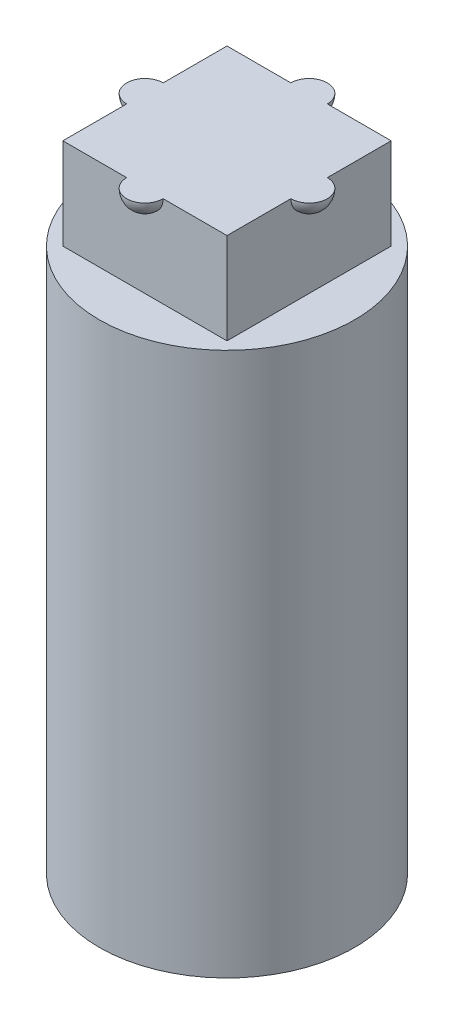
ISO-10303-21;
HEADER;
FILE_DESCRIPTION(('STEP AP214'),'2;1');
FILE_NAME('part.step','',(''),(''),'','','');
FILE_SCHEMA(('AUTOMOTIVE_DESIGN { 1 0 10303 214 1 1 1 1 }'));
ENDSEC;
DATA;
#1=APPLICATION_CONTEXT('core data for automotive mechanical design processes');
#2=APPLICATION_PROTOCOL_DEFINITION('international standard','automotive_design',2000,#1);
#3=PRODUCT_CONTEXT('',#1,'mechanical');
#4=PRODUCT('Part','Part','',(#3));
#5=PRODUCT_RELATED_PRODUCT_CATEGORY('part','',(#4));
#6=PRODUCT_DEFINITION_FORMATION('','',#4);
#7=PRODUCT_DEFINITION_CONTEXT('part definition',#1,'design');
#8=PRODUCT_DEFINITION('design','',#6,#7);
#9=PRODUCT_DEFINITION_SHAPE('','',#8);
#10=(LENGTH_UNIT() NAMED_UNIT(*) SI_UNIT(.MILLI.,.METRE.));
#11=(NAMED_UNIT(*) PLANE_ANGLE_UNIT() SI_UNIT($,.RADIAN.));
#12=(NAMED_UNIT(*) SI_UNIT($,.STERADIAN.) SOLID_ANGLE_UNIT());
#13=UNCERTAINTY_MEASURE_WITH_UNIT(LENGTH_MEASURE(1.E-05),#10,'distance_accuracy_value','');
#14=(GEOMETRIC_REPRESENTATION_CONTEXT(3) GLOBAL_UNCERTAINTY_ASSIGNED_CONTEXT((#13)) GLOBAL_UNIT_ASSIGNED_CONTEXT((#10,
#11,#12)) REPRESENTATION_CONTEXT('',''));
#15=CARTESIAN_POINT('',(0.,0.,0.));
#16=DIRECTION('',(0.,0.,1.));
#17=DIRECTION('',(1.,0.,0.));
#18=AXIS2_PLACEMENT_3D('',#15,#16,#17);
#19=CARTESIAN_POINT('',(0.,17.4,2.25));
#20=DIRECTION('',(0.,0.,-1.));
#21=DIRECTION('',(1.,0.,0.));
#22=AXIS2_PLACEMENT_3D('',#19,#20,#21);
#23=SPHERICAL_SURFACE('',#22,0.5);
#24=CARTESIAN_POINT('',(0.,17.4,2.25));
#25=DIRECTION('',(0.,0.,-1.));
#26=DIRECTION('',(-1.,0.,0.));
#27=AXIS2_PLACEMENT_3D('',#24,#25,#26);
#28=CIRCLE('',#27,0.5);
#29=CARTESIAN_POINT('',(0.5,17.4,2.25));
#30=VERTEX_POINT('',#29);
#31=CARTESIAN_POINT('',(-0.5,17.4,2.25));
#32=VERTEX_POINT('',#31);
#33=EDGE_CURVE('E176',#30,#32,#28,.T.);
#34=ORIENTED_EDGE('',*,*,#33,.F.);
#35=CARTESIAN_POINT('',(0.,17.4,2.25));
#36=DIRECTION('',(0.,1.,0.));
#37=DIRECTION('',(0.,0.,1.));
#38=AXIS2_PLACEMENT_3D('',#35,#36,#37);
#39=CIRCLE('',#38,0.5);
#40=EDGE_CURVE('E486',#30,#32,#39,.F.);
#41=ORIENTED_EDGE('',*,*,#40,.T.);
#42=EDGE_LOOP('',(#34,#41));
#43=FACE_BOUND('',#42,.T.);
#44=ADVANCED_FACE('F34',(#43),#23,.T.);
#45=CARTESIAN_POINT('',(0.,17.4,-2.25));
#46=DIRECTION('',(0.,0.,-1.));
#47=DIRECTION('',(1.,0.,0.));
#48=AXIS2_PLACEMENT_3D('',#45,#46,#47);
#49=SPHERICAL_SURFACE('',#48,0.5);
#50=CARTESIAN_POINT('',(0.,17.4,-2.25));
#51=DIRECTION('',(0.,0.,1.));
#52=DIRECTION('',(1.,0.,0.));
#53=AXIS2_PLACEMENT_3D('',#50,#51,#52);
#54=CIRCLE('',#53,0.5);
#55=CARTESIAN_POINT('',(-0.5,17.4,-2.25));
#56=VERTEX_POINT('',#55);
#57=CARTESIAN_POINT('',(0.5,17.4,-2.25));
#58=VERTEX_POINT('',#57);
#59=EDGE_CURVE('E491',#56,#58,#54,.T.);
#60=ORIENTED_EDGE('',*,*,#59,.F.);
#61=CARTESIAN_POINT('',(0.,17.4,-2.25));
#62=DIRECTION('',(0.,1.,0.));
#63=DIRECTION('',(0.,0.,1.));
#64=AXIS2_PLACEMENT_3D('',#61,#62,#63);
#65=CIRCLE('',#64,0.5);
#66=EDGE_CURVE('E56',#56,#58,#65,.F.);
#67=ORIENTED_EDGE('',*,*,#66,.T.);
#68=EDGE_LOOP('',(#60,#67));
#69=FACE_BOUND('',#68,.T.);
#70=ADVANCED_FACE('F309',(#69),#49,.T.);
#71=CARTESIAN_POINT('',(2.25,17.4,0.));
#72=DIRECTION('',(-1.,0.,0.));
#73=DIRECTION('',(0.,0.,-1.));
#74=AXIS2_PLACEMENT_3D('',#71,#72,#73);
#75=SPHERICAL_SURFACE('',#74,0.5);
#76=CARTESIAN_POINT('',(2.25,17.4,0.));
#77=DIRECTION('',(0.,1.,0.));
#78=DIRECTION('',(0.,0.,1.));
#79=AXIS2_PLACEMENT_3D('',#76,#77,#78);
#80=CIRCLE('',#79,0.5);
#81=CARTESIAN_POINT('',(2.25,17.4,0.5));
#82=VERTEX_POINT('',#81);
#83=CARTESIAN_POINT('',(2.25,17.4,-0.5));
#84=VERTEX_POINT('',#83);
#85=EDGE_CURVE('E49',#82,#84,#80,.T.);
#86=ORIENTED_EDGE('',*,*,#85,.F.);
#87=CARTESIAN_POINT('',(2.25,17.4,0.));
#88=DIRECTION('',(-1.,0.,0.));
#89=DIRECTION('',(0.,0.,1.));
#90=AXIS2_PLACEMENT_3D('',#87,#88,#89);
#91=CIRCLE('',#90,0.5);
#92=EDGE_CURVE('E156',#82,#84,#91,.F.);
#93=ORIENTED_EDGE('',*,*,#92,.T.);
#94=EDGE_LOOP('',(#86,#93));
#95=FACE_BOUND('',#94,.T.);
#96=ADVANCED_FACE('F315',(#95),#75,.T.);
#97=CARTESIAN_POINT('',(-2.25,17.4,0.));
#98=DIRECTION('',(-1.,0.,0.));
#99=DIRECTION('',(0.,0.,-1.));
#100=AXIS2_PLACEMENT_3D('',#97,#98,#99);
#101=SPHERICAL_SURFACE('',#100,0.5);
#102=CARTESIAN_POINT('',(-2.25,17.4,0.));
#103=DIRECTION('',(0.,1.,0.));
#104=DIRECTION('',(0.,0.,1.));
#105=AXIS2_PLACEMENT_3D('',#102,#103,#104);
#106=CIRCLE('',#105,0.5);
#107=CARTESIAN_POINT('',(-2.25,17.4,-0.5));
#108=VERTEX_POINT('',#107);
#109=CARTESIAN_POINT('',(-2.25,17.4,0.5));
#110=VERTEX_POINT('',#109);
#111=EDGE_CURVE('E11',#108,#110,#106,.T.);
#112=ORIENTED_EDGE('',*,*,#111,.F.);
#113=CARTESIAN_POINT('',(-2.25,17.4,0.));
#114=DIRECTION('',(1.,0.,0.));
#115=DIRECTION('',(0.,0.,-1.));
#116=AXIS2_PLACEMENT_3D('',#113,#114,#115);
#117=CIRCLE('',#116,0.5);
#118=EDGE_CURVE('E153',#108,#110,#117,.F.);
#119=ORIENTED_EDGE('',*,*,#118,.T.);
#120=EDGE_LOOP('',(#112,#119));
#121=FACE_BOUND('',#120,.T.);
#122=ADVANCED_FACE('F154',(#121),#101,.T.);
#123=CARTESIAN_POINT('',(0.,14.9,0.));
#124=DIRECTION('',(0.,1.,0.));
#125=DIRECTION('',(0.,0.,1.));
#126=AXIS2_PLACEMENT_3D('',#123,#124,#125);
#127=PLANE('',#126);
#128=CARTESIAN_POINT('',(0.,14.9,0.));
#129=DIRECTION('',(0.,1.,0.));
#130=DIRECTION('',(0.,0.,1.));
#131=AXIS2_PLACEMENT_3D('',#128,#129,#130);
#132=CIRCLE('',#131,3.5);
#133=CARTESIAN_POINT('',(0.,14.9,3.5));
#134=VERTEX_POINT('',#133);
#135=EDGE_CURVE('E191',#134,#134,#132,.T.);
#136=ORIENTED_EDGE('',*,*,#135,.T.);
#137=EDGE_LOOP('',(#136));
#138=FACE_BOUND('',#137,.T.);
#139=DIRECTION('',(-1.,0.,0.));
#140=VECTOR('',#139,1.);
#141=CARTESIAN_POINT('',(-2.25,14.9,-2.25));
#142=LINE('',#141,#140);
#143=CARTESIAN_POINT('',(2.25,14.9,-2.25));
#144=VERTEX_POINT('',#143);
#145=CARTESIAN_POINT('',(-2.25,14.9,-2.25));
#146=VERTEX_POINT('',#145);
#147=EDGE_CURVE('E175',#144,#146,#142,.T.);
#148=ORIENTED_EDGE('',*,*,#147,.F.);
#149=DIRECTION('',(0.,0.,-1.));
#150=VECTOR('',#149,1.);
#151=CARTESIAN_POINT('',(2.25,14.9,-2.25));
#152=LINE('',#151,#150);
#153=CARTESIAN_POINT('',(2.25,14.9,2.25));
#154=VERTEX_POINT('',#153);
#155=EDGE_CURVE('E172',#154,#144,#152,.T.);
#156=ORIENTED_EDGE('',*,*,#155,.F.);
#157=DIRECTION('',(1.,0.,0.));
#158=VECTOR('',#157,1.);
#159=CARTESIAN_POINT('',(-2.25,14.9,2.25));
#160=LINE('',#159,#158);
#161=CARTESIAN_POINT('',(-2.25,14.9,2.25));
#162=VERTEX_POINT('',#161);
#163=EDGE_CURVE('E180',#162,#154,#160,.T.);
#164=ORIENTED_EDGE('',*,*,#163,.F.);
#165=DIRECTION('',(0.,0.,1.));
#166=VECTOR('',#165,1.);
#167=CARTESIAN_POINT('',(-2.25,14.9,-2.25));
#168=LINE('',#167,#166);
#169=EDGE_CURVE('E178',#146,#162,#168,.T.);
#170=ORIENTED_EDGE('',*,*,#169,.F.);
#171=EDGE_LOOP('',(#148,#156,#164,#170));
#172=FACE_BOUND('',#171,.T.);
#173=ADVANCED_FACE('F267',(#138,#172),#127,.T.);
#174=CARTESIAN_POINT('',(0.,0.,0.));
#175=DIRECTION('',(0.,1.,0.));
#176=DIRECTION('',(0.,0.,1.));
#177=AXIS2_PLACEMENT_3D('',#174,#175,#176);
#178=PLANE('',#177);
#179=CARTESIAN_POINT('',(0.,0.,0.));
#180=DIRECTION('',(0.,1.,0.));
#181=DIRECTION('',(0.,0.,1.));
#182=AXIS2_PLACEMENT_3D('',#179,#180,#181);
#183=CIRCLE('',#182,3.5);
#184=CARTESIAN_POINT('',(0.,0.,3.5));
#185=VERTEX_POINT('',#184);
#186=EDGE_CURVE('E42',#185,#185,#183,.T.);
#187=ORIENTED_EDGE('',*,*,#186,.F.);
#188=EDGE_LOOP('',(#187));
#189=FACE_BOUND('',#188,.T.);
#190=CARTESIAN_POINT('',(1.2,0.,1.2));
#191=DIRECTION('',(0.,1.,0.));
#192=DIRECTION('',(0.,0.,1.));
#193=AXIS2_PLACEMENT_3D('',#190,#191,#192);
#194=CIRCLE('',#193,0.25);
#195=CARTESIAN_POINT('',(0.95,0.,1.2));
#196=VERTEX_POINT('',#195);
#197=CARTESIAN_POINT('',(1.2,0.,0.95));
#198=VERTEX_POINT('',#197);
#199=EDGE_CURVE('E194',#196,#198,#194,.T.);
#200=ORIENTED_EDGE('',*,*,#199,.T.);
#201=DIRECTION('',(0.,0.,-1.));
#202=VECTOR('',#201,1.);
#203=CARTESIAN_POINT('',(1.2,0.,-0.95));
#204=LINE('',#203,#202);
#205=CARTESIAN_POINT('',(1.2,0.,-0.95));
#206=VERTEX_POINT('',#205);
#207=EDGE_CURVE('E223',#198,#206,#204,.T.);
#208=ORIENTED_EDGE('',*,*,#207,.T.);
#209=CARTESIAN_POINT('',(1.2,0.,-1.2));
#210=DIRECTION('',(0.,1.,0.));
#211=DIRECTION('',(0.,0.,1.));
#212=AXIS2_PLACEMENT_3D('',#209,#210,#211);
#213=CIRCLE('',#212,0.25);
#214=CARTESIAN_POINT('',(0.95,0.,-1.2));
#215=VERTEX_POINT('',#214);
#216=EDGE_CURVE('E226',#206,#215,#213,.T.);
#217=ORIENTED_EDGE('',*,*,#216,.T.);
#218=DIRECTION('',(-1.,0.,0.));
#219=VECTOR('',#218,1.);
#220=CARTESIAN_POINT('',(-0.95,0.,-1.2));
#221=LINE('',#220,#219);
#222=CARTESIAN_POINT('',(-0.95,0.,-1.2));
#223=VERTEX_POINT('',#222);
#224=EDGE_CURVE('E229',#215,#223,#221,.T.);
#225=ORIENTED_EDGE('',*,*,#224,.T.);
#226=CARTESIAN_POINT('',(-1.2,0.,-1.2));
#227=DIRECTION('',(0.,1.,0.));
#228=DIRECTION('',(0.,0.,1.));
#229=AXIS2_PLACEMENT_3D('',#226,#227,#228);
#230=CIRCLE('',#229,0.25);
#231=CARTESIAN_POINT('',(-1.2,0.,-0.95));
#232=VERTEX_POINT('',#231);
#233=EDGE_CURVE('E232',#223,#232,#230,.T.);
#234=ORIENTED_EDGE('',*,*,#233,.T.);
#235=DIRECTION('',(0.,0.,1.));
#236=VECTOR('',#235,1.);
#237=CARTESIAN_POINT('',(-1.2,0.,-0.95));
#238=LINE('',#237,#236);
#239=CARTESIAN_POINT('',(-1.2,0.,0.95));
#240=VERTEX_POINT('',#239);
#241=EDGE_CURVE('E235',#232,#240,#238,.T.);
#242=ORIENTED_EDGE('',*,*,#241,.T.);
#243=CARTESIAN_POINT('',(-1.2,0.,1.2));
#244=DIRECTION('',(0.,1.,0.));
#245=DIRECTION('',(0.,0.,1.));
#246=AXIS2_PLACEMENT_3D('',#243,#244,#245);
#247=CIRCLE('',#246,0.25);
#248=CARTESIAN_POINT('',(-0.95,0.,1.2));
#249=VERTEX_POINT('',#248);
#250=EDGE_CURVE('E238',#240,#249,#247,.T.);
#251=ORIENTED_EDGE('',*,*,#250,.T.);
#252=DIRECTION('',(1.,0.,0.));
#253=VECTOR('',#252,1.);
#254=CARTESIAN_POINT('',(-0.95,0.,1.2));
#255=LINE('',#254,#253);
#256=EDGE_CURVE('E199',#249,#196,#255,.T.);
#257=ORIENTED_EDGE('',*,*,#256,.T.);
#258=EDGE_LOOP('',(#200,#208,#217,#225,#234,#242,#251,#257));
#259=FACE_BOUND('',#258,.T.);
#260=ADVANCED_FACE('F264',(#189,#259),#178,.F.);
#261=CARTESIAN_POINT('',(0.,4.,0.));
#262=DIRECTION('',(0.,-1.,0.));
#263=DIRECTION('',(0.,0.,-1.));
#264=AXIS2_PLACEMENT_3D('',#261,#262,#263);
#265=CYLINDRICAL_SURFACE('',#264,3.5);
#266=ORIENTED_EDGE('',*,*,#186,.T.);
#267=EDGE_LOOP('',(#266));
#268=FACE_BOUND('',#267,.T.);
#269=ORIENTED_EDGE('',*,*,#135,.F.);
#270=EDGE_LOOP('',(#269));
#271=FACE_BOUND('',#270,.T.);
#272=ADVANCED_FACE('F36',(#268,#271),#265,.T.);
#273=CARTESIAN_POINT('',(1.2,4.,1.2));
#274=DIRECTION('',(0.,-1.,0.));
#275=DIRECTION('',(0.,0.,-1.));
#276=AXIS2_PLACEMENT_3D('',#273,#274,#275);
#277=CYLINDRICAL_SURFACE('',#276,0.25);
#278=ORIENTED_EDGE('',*,*,#199,.F.);
#279=DIRECTION('',(0.,-1.,0.));
#280=VECTOR('',#279,1.);
#281=CARTESIAN_POINT('',(0.95,4.,1.2));
#282=LINE('',#281,#280);
#283=CARTESIAN_POINT('',(0.95,4.,1.2));
#284=VERTEX_POINT('',#283);
#285=EDGE_CURVE('E220',#284,#196,#282,.T.);
#286=ORIENTED_EDGE('',*,*,#285,.F.);
#287=CARTESIAN_POINT('',(1.2,4.,1.2));
#288=DIRECTION('',(0.,1.,0.));
#289=DIRECTION('',(0.,0.,1.));
#290=AXIS2_PLACEMENT_3D('',#287,#288,#289);
#291=CIRCLE('',#290,0.25);
#292=CARTESIAN_POINT('',(1.2,4.,0.95));
#293=VERTEX_POINT('',#292);
#294=EDGE_CURVE('E195',#284,#293,#291,.T.);
#295=ORIENTED_EDGE('',*,*,#294,.T.);
#296=DIRECTION('',(0.,-1.,0.));
#297=VECTOR('',#296,1.);
#298=CARTESIAN_POINT('',(1.2,4.,0.95));
#299=LINE('',#298,#297);
#300=EDGE_CURVE('E257',#293,#198,#299,.T.);
#301=ORIENTED_EDGE('',*,*,#300,.T.);
#302=EDGE_LOOP('',(#278,#286,#295,#301));
#303=FACE_BOUND('',#302,.T.);
#304=ADVANCED_FACE('F271',(#303),#277,.F.);
#305=CARTESIAN_POINT('',(1.2,4.,-0.95));
#306=DIRECTION('',(-1.,0.,0.));
#307=DIRECTION('',(0.,0.,1.));
#308=AXIS2_PLACEMENT_3D('',#305,#306,#307);
#309=PLANE('',#308);
#310=ORIENTED_EDGE('',*,*,#207,.F.);
#311=ORIENTED_EDGE('',*,*,#300,.F.);
#312=DIRECTION('',(0.,0.,-1.));
#313=VECTOR('',#312,1.);
#314=CARTESIAN_POINT('',(1.2,4.,-0.95));
#315=LINE('',#314,#313);
#316=CARTESIAN_POINT('',(1.2,4.,-0.95));
#317=VERTEX_POINT('',#316);
#318=EDGE_CURVE('E198',#293,#317,#315,.T.);
#319=ORIENTED_EDGE('',*,*,#318,.T.);
#320=DIRECTION('',(0.,-1.,0.));
#321=VECTOR('',#320,1.);
#322=CARTESIAN_POINT('',(1.2,4.,-0.95));
#323=LINE('',#322,#321);
#324=EDGE_CURVE('E255',#317,#206,#323,.T.);
#325=ORIENTED_EDGE('',*,*,#324,.T.);
#326=EDGE_LOOP('',(#310,#311,#319,#325));
#327=FACE_BOUND('',#326,.T.);
#328=ADVANCED_FACE('F279',(#327),#309,.T.);
#329=CARTESIAN_POINT('',(1.2,4.,-1.2));
#330=DIRECTION('',(0.,-1.,0.));
#331=DIRECTION('',(0.,0.,-1.));
#332=AXIS2_PLACEMENT_3D('',#329,#330,#331);
#333=CYLINDRICAL_SURFACE('',#332,0.25);
#334=ORIENTED_EDGE('',*,*,#216,.F.);
#335=ORIENTED_EDGE('',*,*,#324,.F.);
#336=CARTESIAN_POINT('',(1.2,4.,-1.2));
#337=DIRECTION('',(0.,1.,0.));
#338=DIRECTION('',(0.,0.,1.));
#339=AXIS2_PLACEMENT_3D('',#336,#337,#338);
#340=CIRCLE('',#339,0.25);
#341=CARTESIAN_POINT('',(0.95,4.,-1.2));
#342=VERTEX_POINT('',#341);
#343=EDGE_CURVE('E202',#317,#342,#340,.T.);
#344=ORIENTED_EDGE('',*,*,#343,.T.);
#345=DIRECTION('',(0.,-1.,0.));
#346=VECTOR('',#345,1.);
#347=CARTESIAN_POINT('',(0.95,4.,-1.2));
#348=LINE('',#347,#346);
#349=EDGE_CURVE('E253',#342,#215,#348,.T.);
#350=ORIENTED_EDGE('',*,*,#349,.T.);
#351=EDGE_LOOP('',(#334,#335,#344,#350));
#352=FACE_BOUND('',#351,.T.);
#353=ADVANCED_FACE('F283',(#352),#333,.F.);
#354=CARTESIAN_POINT('',(-0.95,4.,-1.2));
#355=DIRECTION('',(0.,0.,1.));
#356=DIRECTION('',(1.,0.,0.));
#357=AXIS2_PLACEMENT_3D('',#354,#355,#356);
#358=PLANE('',#357);
#359=ORIENTED_EDGE('',*,*,#224,.F.);
#360=ORIENTED_EDGE('',*,*,#349,.F.);
#361=DIRECTION('',(-1.,0.,0.));
#362=VECTOR('',#361,1.);
#363=CARTESIAN_POINT('',(-0.95,4.,-1.2));
#364=LINE('',#363,#362);
#365=CARTESIAN_POINT('',(-0.95,4.,-1.2));
#366=VERTEX_POINT('',#365);
#367=EDGE_CURVE('E205',#342,#366,#364,.T.);
#368=ORIENTED_EDGE('',*,*,#367,.T.);
#369=DIRECTION('',(0.,-1.,0.));
#370=VECTOR('',#369,1.);
#371=CARTESIAN_POINT('',(-0.95,4.,-1.2));
#372=LINE('',#371,#370);
#373=EDGE_CURVE('E251',#366,#223,#372,.T.);
#374=ORIENTED_EDGE('',*,*,#373,.T.);
#375=EDGE_LOOP('',(#359,#360,#368,#374));
#376=FACE_BOUND('',#375,.T.);
#377=ADVANCED_FACE('F288',(#376),#358,.T.);
#378=CARTESIAN_POINT('',(-1.2,4.,-1.2));
#379=DIRECTION('',(0.,-1.,0.));
#380=DIRECTION('',(0.,0.,-1.));
#381=AXIS2_PLACEMENT_3D('',#378,#379,#380);
#382=CYLINDRICAL_SURFACE('',#381,0.25);
#383=ORIENTED_EDGE('',*,*,#233,.F.);
#384=ORIENTED_EDGE('',*,*,#373,.F.);
#385=CARTESIAN_POINT('',(-1.2,4.,-1.2));
#386=DIRECTION('',(0.,1.,0.));
#387=DIRECTION('',(0.,0.,1.));
#388=AXIS2_PLACEMENT_3D('',#385,#386,#387);
#389=CIRCLE('',#388,0.25);
#390=CARTESIAN_POINT('',(-1.2,4.,-0.95));
#391=VERTEX_POINT('',#390);
#392=EDGE_CURVE('E208',#366,#391,#389,.T.);
#393=ORIENTED_EDGE('',*,*,#392,.T.);
#394=DIRECTION('',(0.,-1.,0.));
#395=VECTOR('',#394,1.);
#396=CARTESIAN_POINT('',(-1.2,4.,-0.95));
#397=LINE('',#396,#395);
#398=EDGE_CURVE('E249',#391,#232,#397,.T.);
#399=ORIENTED_EDGE('',*,*,#398,.T.);
#400=EDGE_LOOP('',(#383,#384,#393,#399));
#401=FACE_BOUND('',#400,.T.);
#402=ADVANCED_FACE('F291',(#401),#382,.F.);
#403=CARTESIAN_POINT('',(-1.2,4.,-0.95));
#404=DIRECTION('',(1.,0.,0.));
#405=DIRECTION('',(0.,0.,-1.));
#406=AXIS2_PLACEMENT_3D('',#403,#404,#405);
#407=PLANE('',#406);
#408=ORIENTED_EDGE('',*,*,#241,.F.);
#409=ORIENTED_EDGE('',*,*,#398,.F.);
#410=DIRECTION('',(0.,0.,1.));
#411=VECTOR('',#410,1.);
#412=CARTESIAN_POINT('',(-1.2,4.,-0.95));
#413=LINE('',#412,#411);
#414=CARTESIAN_POINT('',(-1.2,4.,0.95));
#415=VERTEX_POINT('',#414);
#416=EDGE_CURVE('E211',#391,#415,#413,.T.);
#417=ORIENTED_EDGE('',*,*,#416,.T.);
#418=DIRECTION('',(0.,-1.,0.));
#419=VECTOR('',#418,1.);
#420=CARTESIAN_POINT('',(-1.2,4.,0.95));
#421=LINE('',#420,#419);
#422=EDGE_CURVE('E247',#415,#240,#421,.T.);
#423=ORIENTED_EDGE('',*,*,#422,.T.);
#424=EDGE_LOOP('',(#408,#409,#417,#423));
#425=FACE_BOUND('',#424,.T.);
#426=ADVANCED_FACE('F295',(#425),#407,.T.);
#427=CARTESIAN_POINT('',(-1.2,4.,1.2));
#428=DIRECTION('',(0.,-1.,0.));
#429=DIRECTION('',(0.,0.,-1.));
#430=AXIS2_PLACEMENT_3D('',#427,#428,#429);
#431=CYLINDRICAL_SURFACE('',#430,0.25);
#432=ORIENTED_EDGE('',*,*,#250,.F.);
#433=ORIENTED_EDGE('',*,*,#422,.F.);
#434=CARTESIAN_POINT('',(-1.2,4.,1.2));
#435=DIRECTION('',(0.,1.,0.));
#436=DIRECTION('',(0.,0.,1.));
#437=AXIS2_PLACEMENT_3D('',#434,#435,#436);
#438=CIRCLE('',#437,0.25);
#439=CARTESIAN_POINT('',(-0.95,4.,1.2));
#440=VERTEX_POINT('',#439);
#441=EDGE_CURVE('E214',#415,#440,#438,.T.);
#442=ORIENTED_EDGE('',*,*,#441,.T.);
#443=DIRECTION('',(0.,-1.,0.));
#444=VECTOR('',#443,1.);
#445=CARTESIAN_POINT('',(-0.95,4.,1.2));
#446=LINE('',#445,#444);
#447=EDGE_CURVE('E245',#440,#249,#446,.T.);
#448=ORIENTED_EDGE('',*,*,#447,.T.);
#449=EDGE_LOOP('',(#432,#433,#442,#448));
#450=FACE_BOUND('',#449,.T.);
#451=ADVANCED_FACE('F299',(#450),#431,.F.);
#452=CARTESIAN_POINT('',(-0.95,4.,1.2));
#453=DIRECTION('',(0.,0.,-1.));
#454=DIRECTION('',(-1.,0.,0.));
#455=AXIS2_PLACEMENT_3D('',#452,#453,#454);
#456=PLANE('',#455);
#457=ORIENTED_EDGE('',*,*,#256,.F.);
#458=ORIENTED_EDGE('',*,*,#447,.F.);
#459=DIRECTION('',(1.,0.,0.));
#460=VECTOR('',#459,1.);
#461=CARTESIAN_POINT('',(-0.95,4.,1.2));
#462=LINE('',#461,#460);
#463=EDGE_CURVE('E217',#440,#284,#462,.T.);
#464=ORIENTED_EDGE('',*,*,#463,.T.);
#465=ORIENTED_EDGE('',*,*,#285,.T.);
#466=EDGE_LOOP('',(#457,#458,#464,#465));
#467=FACE_BOUND('',#466,.T.);
#468=ADVANCED_FACE('F274',(#467),#456,.T.);
#469=CARTESIAN_POINT('',(0.,4.,0.));
#470=DIRECTION('',(0.,1.,0.));
#471=DIRECTION('',(0.,0.,1.));
#472=AXIS2_PLACEMENT_3D('',#469,#470,#471);
#473=PLANE('',#472);
#474=ORIENTED_EDGE('',*,*,#294,.F.);
#475=ORIENTED_EDGE('',*,*,#463,.F.);
#476=ORIENTED_EDGE('',*,*,#441,.F.);
#477=ORIENTED_EDGE('',*,*,#416,.F.);
#478=ORIENTED_EDGE('',*,*,#392,.F.);
#479=ORIENTED_EDGE('',*,*,#367,.F.);
#480=ORIENTED_EDGE('',*,*,#343,.F.);
#481=ORIENTED_EDGE('',*,*,#318,.F.);
#482=EDGE_LOOP('',(#474,#475,#476,#477,#478,#479,#480,#481));
#483=FACE_BOUND('',#482,.T.);
#484=ADVANCED_FACE('F277',(#483),#473,.F.);
#485=CARTESIAN_POINT('',(2.25,17.4,-2.25));
#486=DIRECTION('',(-1.,0.,0.));
#487=DIRECTION('',(0.,0.,1.));
#488=AXIS2_PLACEMENT_3D('',#485,#486,#487);
#489=PLANE('',#488);
#490=ORIENTED_EDGE('',*,*,#92,.F.);
#491=DIRECTION('',(0.,0.,-1.));
#492=VECTOR('',#491,1.);
#493=CARTESIAN_POINT('',(2.25,17.4,-2.25));
#494=LINE('',#493,#492);
#495=CARTESIAN_POINT('',(2.25,17.4,2.25));
#496=VERTEX_POINT('',#495);
#497=EDGE_CURVE('E489',#496,#82,#494,.T.);
#498=ORIENTED_EDGE('',*,*,#497,.F.);
#499=DIRECTION('',(0.,-1.,0.));
#500=VECTOR('',#499,1.);
#501=CARTESIAN_POINT('',(2.25,17.4,2.25));
#502=LINE('',#501,#500);
#503=EDGE_CURVE('E171',#496,#154,#502,.T.);
#504=ORIENTED_EDGE('',*,*,#503,.T.);
#505=ORIENTED_EDGE('',*,*,#155,.T.);
#506=DIRECTION('',(0.,-1.,0.));
#507=VECTOR('',#506,1.);
#508=CARTESIAN_POINT('',(2.25,17.4,-2.25));
#509=LINE('',#508,#507);
#510=CARTESIAN_POINT('',(2.25,17.4,-2.25));
#511=VERTEX_POINT('',#510);
#512=EDGE_CURVE('E189',#511,#144,#509,.T.);
#513=ORIENTED_EDGE('',*,*,#512,.F.);
#514=EDGE_CURVE('E182',#84,#511,#494,.T.);
#515=ORIENTED_EDGE('',*,*,#514,.F.);
#516=EDGE_LOOP('',(#490,#498,#504,#505,#513,#515));
#517=FACE_BOUND('',#516,.T.);
#518=ADVANCED_FACE('F332',(#517),#489,.F.);
#519=CARTESIAN_POINT('',(-2.25,17.4,-2.25));
#520=DIRECTION('',(0.,0.,1.));
#521=DIRECTION('',(1.,0.,0.));
#522=AXIS2_PLACEMENT_3D('',#519,#520,#521);
#523=PLANE('',#522);
#524=DIRECTION('',(-1.,0.,0.));
#525=VECTOR('',#524,1.);
#526=CARTESIAN_POINT('',(-2.25,17.4,-2.25));
#527=LINE('',#526,#525);
#528=CARTESIAN_POINT('',(-2.25,17.4,-2.25));
#529=VERTEX_POINT('',#528);
#530=EDGE_CURVE('E165',#56,#529,#527,.T.);
#531=ORIENTED_EDGE('',*,*,#530,.F.);
#532=ORIENTED_EDGE('',*,*,#59,.T.);
#533=EDGE_CURVE('E162',#511,#58,#527,.T.);
#534=ORIENTED_EDGE('',*,*,#533,.F.);
#535=ORIENTED_EDGE('',*,*,#512,.T.);
#536=ORIENTED_EDGE('',*,*,#147,.T.);
#537=DIRECTION('',(0.,-1.,0.));
#538=VECTOR('',#537,1.);
#539=CARTESIAN_POINT('',(-2.25,17.4,-2.25));
#540=LINE('',#539,#538);
#541=EDGE_CURVE('E186',#529,#146,#540,.T.);
#542=ORIENTED_EDGE('',*,*,#541,.F.);
#543=EDGE_LOOP('',(#531,#532,#534,#535,#536,#542));
#544=FACE_BOUND('',#543,.T.);
#545=ADVANCED_FACE('F329',(#544),#523,.F.);
#546=CARTESIAN_POINT('',(-2.25,17.4,-2.25));
#547=DIRECTION('',(1.,0.,0.));
#548=DIRECTION('',(0.,0.,-1.));
#549=AXIS2_PLACEMENT_3D('',#546,#547,#548);
#550=PLANE('',#549);
#551=ORIENTED_EDGE('',*,*,#118,.F.);
#552=DIRECTION('',(0.,0.,1.));
#553=VECTOR('',#552,1.);
#554=CARTESIAN_POINT('',(-2.25,17.4,-2.25));
#555=LINE('',#554,#553);
#556=EDGE_CURVE('E150',#529,#108,#555,.T.);
#557=ORIENTED_EDGE('',*,*,#556,.F.);
#558=ORIENTED_EDGE('',*,*,#541,.T.);
#559=ORIENTED_EDGE('',*,*,#169,.T.);
#560=DIRECTION('',(0.,-1.,0.));
#561=VECTOR('',#560,1.);
#562=CARTESIAN_POINT('',(-2.25,17.4,2.25));
#563=LINE('',#562,#561);
#564=CARTESIAN_POINT('',(-2.25,17.4,2.25));
#565=VERTEX_POINT('',#564);
#566=EDGE_CURVE('E160',#565,#162,#563,.T.);
#567=ORIENTED_EDGE('',*,*,#566,.F.);
#568=EDGE_CURVE('E147',#110,#565,#555,.T.);
#569=ORIENTED_EDGE('',*,*,#568,.F.);
#570=EDGE_LOOP('',(#551,#557,#558,#559,#567,#569));
#571=FACE_BOUND('',#570,.T.);
#572=ADVANCED_FACE('F158',(#571),#550,.F.);
#573=CARTESIAN_POINT('',(-2.25,17.4,2.25));
#574=DIRECTION('',(0.,0.,-1.));
#575=DIRECTION('',(-1.,0.,0.));
#576=AXIS2_PLACEMENT_3D('',#573,#574,#575);
#577=PLANE('',#576);
#578=DIRECTION('',(1.,0.,0.));
#579=VECTOR('',#578,1.);
#580=CARTESIAN_POINT('',(-2.25,17.4,2.25));
#581=LINE('',#580,#579);
#582=EDGE_CURVE('E164',#30,#496,#581,.T.);
#583=ORIENTED_EDGE('',*,*,#582,.F.);
#584=ORIENTED_EDGE('',*,*,#33,.T.);
#585=EDGE_CURVE('E169',#565,#32,#581,.T.);
#586=ORIENTED_EDGE('',*,*,#585,.F.);
#587=ORIENTED_EDGE('',*,*,#566,.T.);
#588=ORIENTED_EDGE('',*,*,#163,.T.);
#589=ORIENTED_EDGE('',*,*,#503,.F.);
#590=EDGE_LOOP('',(#583,#584,#586,#587,#588,#589));
#591=FACE_BOUND('',#590,.T.);
#592=ADVANCED_FACE('F323',(#591),#577,.F.);
#593=CARTESIAN_POINT('',(0.,17.4,0.));
#594=DIRECTION('',(0.,1.,0.));
#595=DIRECTION('',(0.,0.,1.));
#596=AXIS2_PLACEMENT_3D('',#593,#594,#595);
#597=PLANE('',#596);
#598=ORIENTED_EDGE('',*,*,#556,.T.);
#599=ORIENTED_EDGE('',*,*,#111,.T.);
#600=ORIENTED_EDGE('',*,*,#568,.T.);
#601=ORIENTED_EDGE('',*,*,#585,.T.);
#602=ORIENTED_EDGE('',*,*,#40,.F.);
#603=ORIENTED_EDGE('',*,*,#582,.T.);
#604=ORIENTED_EDGE('',*,*,#497,.T.);
#605=ORIENTED_EDGE('',*,*,#85,.T.);
#606=ORIENTED_EDGE('',*,*,#514,.T.);
#607=ORIENTED_EDGE('',*,*,#533,.T.);
#608=ORIENTED_EDGE('',*,*,#66,.F.);
#609=ORIENTED_EDGE('',*,*,#530,.T.);
#610=EDGE_LOOP('',(#598,#599,#600,#601,#602,#603,#604,#605,#606,#607,#608,#609));
#611=FACE_BOUND('',#610,.T.);
#612=ADVANCED_FACE('F144',(#611),#597,.T.);
#613=CLOSED_SHELL('',(#44,#70,#96,#122,#173,#260,#272,#304,#328,#353,#377,#402,#426,#451,#468,
#484,#518,#545,#572,#592,#612));
#614=MANIFOLD_SOLID_BREP('B2',#613);
#615=ADVANCED_BREP_SHAPE_REPRESENTATION('',(#18,#614),#14);
#616=SHAPE_DEFINITION_REPRESENTATION(#9,#615);
ENDSEC;
END-ISO-10303-21;
